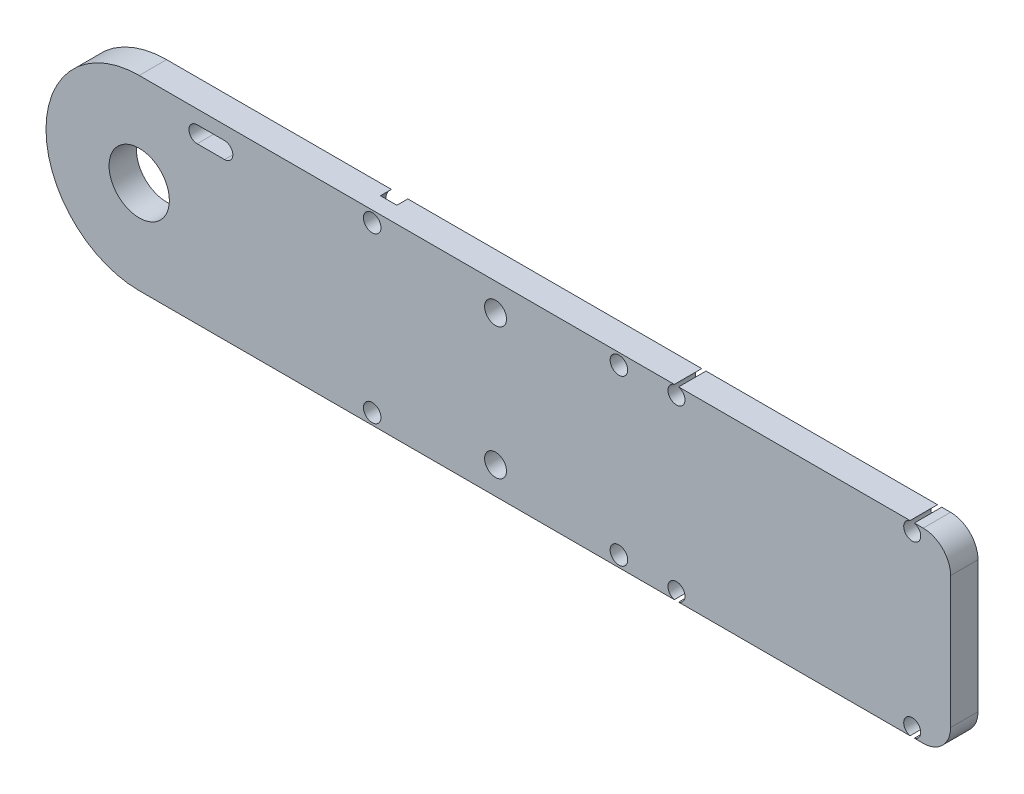
ISO-10303-21;
HEADER;
FILE_DESCRIPTION(('STEP AP214'),'2;1');
FILE_NAME('part.step','',(''),(''),'','','');
FILE_SCHEMA(('AUTOMOTIVE_DESIGN { 1 0 10303 214 1 1 1 1 }'));
ENDSEC;
DATA;
#1=APPLICATION_CONTEXT('core data for automotive mechanical design processes');
#2=APPLICATION_PROTOCOL_DEFINITION('international standard','automotive_design',2000,#1);
#3=PRODUCT_CONTEXT('',#1,'mechanical');
#4=PRODUCT('Part','Part','',(#3));
#5=PRODUCT_RELATED_PRODUCT_CATEGORY('part','',(#4));
#6=PRODUCT_DEFINITION_FORMATION('','',#4);
#7=PRODUCT_DEFINITION_CONTEXT('part definition',#1,'design');
#8=PRODUCT_DEFINITION('design','',#6,#7);
#9=PRODUCT_DEFINITION_SHAPE('','',#8);
#10=(LENGTH_UNIT() NAMED_UNIT(*) SI_UNIT(.MILLI.,.METRE.));
#11=(NAMED_UNIT(*) PLANE_ANGLE_UNIT() SI_UNIT($,.RADIAN.));
#12=(NAMED_UNIT(*) SI_UNIT($,.STERADIAN.) SOLID_ANGLE_UNIT());
#13=UNCERTAINTY_MEASURE_WITH_UNIT(LENGTH_MEASURE(1.E-05),#10,'distance_accuracy_value','');
#14=(GEOMETRIC_REPRESENTATION_CONTEXT(3) GLOBAL_UNCERTAINTY_ASSIGNED_CONTEXT((#13)) GLOBAL_UNIT_ASSIGNED_CONTEXT((#10,
#11,#12)) REPRESENTATION_CONTEXT('',''));
#15=CARTESIAN_POINT('',(0.,0.,0.));
#16=DIRECTION('',(0.,0.,1.));
#17=DIRECTION('',(1.,0.,0.));
#18=AXIS2_PLACEMENT_3D('',#15,#16,#17);
#19=CARTESIAN_POINT('',(42.5,-15.,7.5));
#20=DIRECTION('',(0.,0.,-1.));
#21=DIRECTION('',(-1.,0.,0.));
#22=AXIS2_PLACEMENT_3D('',#19,#20,#21);
#23=CYLINDRICAL_SURFACE('',#22,1.59999999999999);
#24=CARTESIAN_POINT('',(42.5,-15.,2.5));
#25=DIRECTION('',(0.,0.,1.));
#26=DIRECTION('',(1.,0.,0.));
#27=AXIS2_PLACEMENT_3D('',#24,#25,#26);
#28=CIRCLE('',#27,1.59999999999999);
#29=CARTESIAN_POINT('',(44.1,-15.,2.5));
#30=VERTEX_POINT('',#29);
#31=EDGE_CURVE('E352',#30,#30,#28,.T.);
#32=ORIENTED_EDGE('',*,*,#31,.T.);
#33=EDGE_LOOP('',(#32));
#34=FACE_BOUND('',#33,.T.);
#35=CARTESIAN_POINT('',(42.5,-15.,-0.5));
#36=DIRECTION('',(0.,0.,-1.));
#37=DIRECTION('',(-1.,0.,0.));
#38=AXIS2_PLACEMENT_3D('',#35,#36,#37);
#39=CIRCLE('',#38,1.59999999999999);
#40=CARTESIAN_POINT('',(40.9,-15.,-0.5));
#41=VERTEX_POINT('',#40);
#42=EDGE_CURVE('E357',#41,#41,#39,.F.);
#43=ORIENTED_EDGE('',*,*,#42,.F.);
#44=EDGE_LOOP('',(#43));
#45=FACE_BOUND('',#44,.T.);
#46=ADVANCED_FACE('F35',(#34,#45),#23,.F.);
#47=CARTESIAN_POINT('',(42.5,15.,7.5));
#48=DIRECTION('',(0.,0.,-1.));
#49=DIRECTION('',(-1.,0.,0.));
#50=AXIS2_PLACEMENT_3D('',#47,#48,#49);
#51=CYLINDRICAL_SURFACE('',#50,1.59999999999999);
#52=CARTESIAN_POINT('',(42.5,15.,2.5));
#53=DIRECTION('',(0.,0.,1.));
#54=DIRECTION('',(1.,0.,0.));
#55=AXIS2_PLACEMENT_3D('',#52,#53,#54);
#56=CIRCLE('',#55,1.59999999999999);
#57=CARTESIAN_POINT('',(44.1,15.,2.5));
#58=VERTEX_POINT('',#57);
#59=EDGE_CURVE('E262',#58,#58,#56,.F.);
#60=ORIENTED_EDGE('',*,*,#59,.F.);
#61=EDGE_LOOP('',(#60));
#62=FACE_BOUND('',#61,.T.);
#63=CARTESIAN_POINT('',(42.5,15.,-0.5));
#64=DIRECTION('',(0.,0.,-1.));
#65=DIRECTION('',(-1.,0.,0.));
#66=AXIS2_PLACEMENT_3D('',#63,#64,#65);
#67=CIRCLE('',#66,1.59999999999999);
#68=CARTESIAN_POINT('',(40.9,15.,-0.5));
#69=VERTEX_POINT('',#68);
#70=EDGE_CURVE('E359',#69,#69,#67,.T.);
#71=ORIENTED_EDGE('',*,*,#70,.T.);
#72=EDGE_LOOP('',(#71));
#73=FACE_BOUND('',#72,.T.);
#74=ADVANCED_FACE('F456',(#62,#73),#51,.F.);
#75=CARTESIAN_POINT('',(0.,0.,2.5));
#76=DIRECTION('',(0.,0.,1.));
#77=DIRECTION('',(1.,0.,0.));
#78=AXIS2_PLACEMENT_3D('',#75,#76,#77);
#79=PLANE('',#78);
#80=CARTESIAN_POINT('',(65.,-12.,2.5));
#81=DIRECTION('',(0.,0.,-1.));
#82=DIRECTION('',(-1.,0.,0.));
#83=AXIS2_PLACEMENT_3D('',#80,#81,#82);
#84=CIRCLE('',#83,2.);
#85=CARTESIAN_POINT('',(63.,-12.,2.5));
#86=VERTEX_POINT('',#85);
#87=EDGE_CURVE('E310',#86,#86,#84,.F.);
#88=ORIENTED_EDGE('',*,*,#87,.F.);
#89=EDGE_LOOP('',(#88));
#90=FACE_BOUND('',#89,.T.);
#91=CARTESIAN_POINT('',(87.5,15.,2.5));
#92=DIRECTION('',(0.,0.,-1.));
#93=DIRECTION('',(-1.,0.,0.));
#94=AXIS2_PLACEMENT_3D('',#91,#92,#93);
#95=CIRCLE('',#94,1.59999999999999);
#96=CARTESIAN_POINT('',(85.9,15.,2.5));
#97=VERTEX_POINT('',#96);
#98=EDGE_CURVE('E304',#97,#97,#95,.T.);
#99=ORIENTED_EDGE('',*,*,#98,.T.);
#100=EDGE_LOOP('',(#99));
#101=FACE_BOUND('',#100,.T.);
#102=DIRECTION('',(1.,0.,0.));
#103=VECTOR('',#102,1.);
#104=CARTESIAN_POINT('',(0.,-17.,2.5));
#105=LINE('',#104,#103);
#106=CARTESIAN_POINT('',(0.,-17.,2.5));
#107=VERTEX_POINT('',#106);
#108=CARTESIAN_POINT('',(97.6094875162046,-17.,2.5));
#109=VERTEX_POINT('',#108);
#110=EDGE_CURVE('E246',#107,#109,#105,.T.);
#111=ORIENTED_EDGE('',*,*,#110,.T.);
#112=CARTESIAN_POINT('',(98.,-15.5,2.5));
#113=DIRECTION('',(0.,0.,-1.));
#114=DIRECTION('',(-1.,0.,0.));
#115=AXIS2_PLACEMENT_3D('',#112,#113,#114);
#116=CIRCLE('',#115,1.54999999999999);
#117=CARTESIAN_POINT('',(98.3905124837954,-17.,2.5));
#118=VERTEX_POINT('',#117);
#119=EDGE_CURVE('E289',#118,#109,#116,.F.);
#120=ORIENTED_EDGE('',*,*,#119,.F.);
#121=CARTESIAN_POINT('',(140.609487516204,-17.,2.5));
#122=VERTEX_POINT('',#121);
#123=EDGE_CURVE('E249',#118,#122,#105,.T.);
#124=ORIENTED_EDGE('',*,*,#123,.T.);
#125=CARTESIAN_POINT('',(141.,-15.5,2.5));
#126=DIRECTION('',(0.,0.,-1.));
#127=DIRECTION('',(-1.,0.,0.));
#128=AXIS2_PLACEMENT_3D('',#125,#126,#127);
#129=CIRCLE('',#128,1.54999999999999);
#130=CARTESIAN_POINT('',(141.390512483795,-17.,2.5));
#131=VERTEX_POINT('',#130);
#132=EDGE_CURVE('E256',#122,#131,#129,.T.);
#133=ORIENTED_EDGE('',*,*,#132,.T.);
#134=CARTESIAN_POINT('',(143.,-17.,2.5));
#135=VERTEX_POINT('',#134);
#136=EDGE_CURVE('E250',#131,#135,#105,.T.);
#137=ORIENTED_EDGE('',*,*,#136,.T.);
#138=CARTESIAN_POINT('',(143.,-12.,2.5));
#139=DIRECTION('',(0.,0.,1.));
#140=DIRECTION('',(1.,0.,0.));
#141=AXIS2_PLACEMENT_3D('',#138,#139,#140);
#142=CIRCLE('',#141,5.);
#143=CARTESIAN_POINT('',(148.,-12.,2.5));
#144=VERTEX_POINT('',#143);
#145=EDGE_CURVE('E400',#135,#144,#142,.T.);
#146=ORIENTED_EDGE('',*,*,#145,.T.);
#147=DIRECTION('',(0.,-1.,0.));
#148=VECTOR('',#147,1.);
#149=CARTESIAN_POINT('',(148.,0.,2.5));
#150=LINE('',#149,#148);
#151=CARTESIAN_POINT('',(148.,12.,2.5));
#152=VERTEX_POINT('',#151);
#153=EDGE_CURVE('E243',#152,#144,#150,.T.);
#154=ORIENTED_EDGE('',*,*,#153,.F.);
#155=CARTESIAN_POINT('',(143.,12.,2.5));
#156=DIRECTION('',(0.,0.,1.));
#157=DIRECTION('',(1.,0.,0.));
#158=AXIS2_PLACEMENT_3D('',#155,#156,#157);
#159=CIRCLE('',#158,5.);
#160=CARTESIAN_POINT('',(143.,17.,2.5));
#161=VERTEX_POINT('',#160);
#162=EDGE_CURVE('E401',#152,#161,#159,.T.);
#163=ORIENTED_EDGE('',*,*,#162,.T.);
#164=DIRECTION('',(1.,0.,0.));
#165=VECTOR('',#164,1.);
#166=CARTESIAN_POINT('',(0.,17.,2.5));
#167=LINE('',#166,#165);
#168=CARTESIAN_POINT('',(141.390512483795,17.,2.5));
#169=VERTEX_POINT('',#168);
#170=EDGE_CURVE('E242',#169,#161,#167,.T.);
#171=ORIENTED_EDGE('',*,*,#170,.F.);
#172=CARTESIAN_POINT('',(141.,15.5,2.5));
#173=DIRECTION('',(0.,0.,-1.));
#174=DIRECTION('',(-1.,0.,0.));
#175=AXIS2_PLACEMENT_3D('',#172,#173,#174);
#176=CIRCLE('',#175,1.54999999999999);
#177=CARTESIAN_POINT('',(140.609487516205,17.,2.5));
#178=VERTEX_POINT('',#177);
#179=EDGE_CURVE('E269',#178,#169,#176,.F.);
#180=ORIENTED_EDGE('',*,*,#179,.F.);
#181=CARTESIAN_POINT('',(98.3905124837954,17.,2.5));
#182=VERTEX_POINT('',#181);
#183=EDGE_CURVE('E241',#182,#178,#167,.T.);
#184=ORIENTED_EDGE('',*,*,#183,.F.);
#185=CARTESIAN_POINT('',(98.,15.5,2.5));
#186=DIRECTION('',(0.,0.,-1.));
#187=DIRECTION('',(-1.,0.,0.));
#188=AXIS2_PLACEMENT_3D('',#185,#186,#187);
#189=CIRCLE('',#188,1.54999999999999);
#190=CARTESIAN_POINT('',(97.6094875162046,17.,2.5));
#191=VERTEX_POINT('',#190);
#192=EDGE_CURVE('E277',#182,#191,#189,.T.);
#193=ORIENTED_EDGE('',*,*,#192,.T.);
#194=CARTESIAN_POINT('',(0.,17.,2.5));
#195=VERTEX_POINT('',#194);
#196=EDGE_CURVE('E238',#195,#191,#167,.T.);
#197=ORIENTED_EDGE('',*,*,#196,.F.);
#198=CARTESIAN_POINT('',(0.,0.,2.5));
#199=DIRECTION('',(0.,0.,1.));
#200=DIRECTION('',(1.,0.,0.));
#201=AXIS2_PLACEMENT_3D('',#198,#199,#200);
#202=CIRCLE('',#201,17.);
#203=EDGE_CURVE('E211',#195,#107,#202,.T.);
#204=ORIENTED_EDGE('',*,*,#203,.T.);
#205=EDGE_LOOP('',(#111,#120,#124,#133,#137,#146,#154,#163,#171,#180,#184,#193,#197,#204));
#206=FACE_BOUND('',#205,.T.);
#207=CARTESIAN_POINT('',(0.,0.,2.5));
#208=DIRECTION('',(0.,0.,1.));
#209=DIRECTION('',(1.,0.,0.));
#210=AXIS2_PLACEMENT_3D('',#207,#208,#209);
#211=CIRCLE('',#210,5.5);
#212=CARTESIAN_POINT('',(5.5,0.,2.5));
#213=VERTEX_POINT('',#212);
#214=EDGE_CURVE('E234',#213,#213,#211,.T.);
#215=ORIENTED_EDGE('',*,*,#214,.F.);
#216=EDGE_LOOP('',(#215));
#217=FACE_BOUND('',#216,.T.);
#218=CARTESIAN_POINT('',(87.5,-15.,2.5));
#219=DIRECTION('',(0.,0.,-1.));
#220=DIRECTION('',(-1.,0.,0.));
#221=AXIS2_PLACEMENT_3D('',#218,#219,#220);
#222=CIRCLE('',#221,1.59999999999999);
#223=CARTESIAN_POINT('',(85.9,-15.,2.5));
#224=VERTEX_POINT('',#223);
#225=EDGE_CURVE('E298',#224,#224,#222,.F.);
#226=ORIENTED_EDGE('',*,*,#225,.F.);
#227=EDGE_LOOP('',(#226));
#228=FACE_BOUND('',#227,.T.);
#229=CARTESIAN_POINT('',(65.,12.,2.5));
#230=DIRECTION('',(0.,0.,-1.));
#231=DIRECTION('',(-1.,0.,0.));
#232=AXIS2_PLACEMENT_3D('',#229,#230,#231);
#233=CIRCLE('',#232,2.);
#234=CARTESIAN_POINT('',(63.,12.,2.5));
#235=VERTEX_POINT('',#234);
#236=EDGE_CURVE('E316',#235,#235,#233,.T.);
#237=ORIENTED_EDGE('',*,*,#236,.T.);
#238=EDGE_LOOP('',(#237));
#239=FACE_BOUND('',#238,.T.);
#240=DIRECTION('',(-1.,0.,0.));
#241=VECTOR('',#240,1.);
#242=CARTESIAN_POINT('',(0.,11.5,2.5));
#243=LINE('',#242,#241);
#244=CARTESIAN_POINT('',(15.5741759643275,11.5,2.5));
#245=VERTEX_POINT('',#244);
#246=CARTESIAN_POINT('',(10.5741759643275,11.5,2.5));
#247=VERTEX_POINT('',#246);
#248=EDGE_CURVE('E332',#245,#247,#243,.T.);
#249=ORIENTED_EDGE('',*,*,#248,.T.);
#250=CARTESIAN_POINT('',(10.5741759643275,13.,2.5));
#251=DIRECTION('',(0.,0.,-1.));
#252=DIRECTION('',(-1.,0.,0.));
#253=AXIS2_PLACEMENT_3D('',#250,#251,#252);
#254=CIRCLE('',#253,1.5);
#255=CARTESIAN_POINT('',(10.5741759643275,14.5,2.5));
#256=VERTEX_POINT('',#255);
#257=EDGE_CURVE('E345',#247,#256,#254,.T.);
#258=ORIENTED_EDGE('',*,*,#257,.T.);
#259=DIRECTION('',(-1.,0.,0.));
#260=VECTOR('',#259,1.);
#261=CARTESIAN_POINT('',(0.,14.5,2.5));
#262=LINE('',#261,#260);
#263=CARTESIAN_POINT('',(15.5741759643275,14.5,2.5));
#264=VERTEX_POINT('',#263);
#265=EDGE_CURVE('E342',#264,#256,#262,.T.);
#266=ORIENTED_EDGE('',*,*,#265,.F.);
#267=CARTESIAN_POINT('',(15.5741759643275,13.,2.5));
#268=DIRECTION('',(0.,0.,-1.));
#269=DIRECTION('',(-1.,0.,0.));
#270=AXIS2_PLACEMENT_3D('',#267,#268,#269);
#271=CIRCLE('',#270,1.5);
#272=EDGE_CURVE('E324',#264,#245,#271,.T.);
#273=ORIENTED_EDGE('',*,*,#272,.T.);
#274=EDGE_LOOP('',(#249,#258,#266,#273));
#275=FACE_BOUND('',#274,.T.);
#276=ORIENTED_EDGE('',*,*,#31,.F.);
#277=EDGE_LOOP('',(#276));
#278=FACE_BOUND('',#277,.T.);
#279=ORIENTED_EDGE('',*,*,#59,.T.);
#280=EDGE_LOOP('',(#279));
#281=FACE_BOUND('',#280,.T.);
#282=ADVANCED_FACE('F429',(#90,#101,#206,#217,#228,#239,#275,#278,#281),#79,.T.);
#283=CARTESIAN_POINT('',(0.,0.,-2.5));
#284=DIRECTION('',(0.,0.,1.));
#285=DIRECTION('',(1.,0.,0.));
#286=AXIS2_PLACEMENT_3D('',#283,#284,#285);
#287=PLANE('',#286);
#288=CARTESIAN_POINT('',(10.5741759643275,13.,-2.5));
#289=DIRECTION('',(0.,0.,-1.));
#290=DIRECTION('',(-1.,0.,0.));
#291=AXIS2_PLACEMENT_3D('',#288,#289,#290);
#292=CIRCLE('',#291,1.5);
#293=CARTESIAN_POINT('',(10.5741759643275,11.5,-2.5));
#294=VERTEX_POINT('',#293);
#295=CARTESIAN_POINT('',(10.5741759643275,14.5,-2.5));
#296=VERTEX_POINT('',#295);
#297=EDGE_CURVE('E336',#294,#296,#292,.T.);
#298=ORIENTED_EDGE('',*,*,#297,.F.);
#299=DIRECTION('',(-1.,0.,0.));
#300=VECTOR('',#299,1.);
#301=CARTESIAN_POINT('',(0.,11.5,-2.5));
#302=LINE('',#301,#300);
#303=CARTESIAN_POINT('',(15.5741759643275,11.5,-2.5));
#304=VERTEX_POINT('',#303);
#305=EDGE_CURVE('E319',#304,#294,#302,.T.);
#306=ORIENTED_EDGE('',*,*,#305,.F.);
#307=CARTESIAN_POINT('',(15.5741759643275,13.,-2.5));
#308=DIRECTION('',(0.,0.,-1.));
#309=DIRECTION('',(-1.,0.,0.));
#310=AXIS2_PLACEMENT_3D('',#307,#308,#309);
#311=CIRCLE('',#310,1.5);
#312=CARTESIAN_POINT('',(15.5741759643275,14.5,-2.5));
#313=VERTEX_POINT('',#312);
#314=EDGE_CURVE('E329',#313,#304,#311,.T.);
#315=ORIENTED_EDGE('',*,*,#314,.F.);
#316=DIRECTION('',(-1.,0.,0.));
#317=VECTOR('',#316,1.);
#318=CARTESIAN_POINT('',(0.,14.5,-2.5));
#319=LINE('',#318,#317);
#320=EDGE_CURVE('E333',#313,#296,#319,.T.);
#321=ORIENTED_EDGE('',*,*,#320,.T.);
#322=EDGE_LOOP('',(#298,#306,#315,#321));
#323=FACE_BOUND('',#322,.T.);
#324=CARTESIAN_POINT('',(65.,12.,-2.5));
#325=DIRECTION('',(0.,0.,-1.));
#326=DIRECTION('',(-1.,0.,0.));
#327=AXIS2_PLACEMENT_3D('',#324,#325,#326);
#328=CIRCLE('',#327,2.);
#329=CARTESIAN_POINT('',(63.,12.,-2.5));
#330=VERTEX_POINT('',#329);
#331=EDGE_CURVE('E313',#330,#330,#328,.T.);
#332=ORIENTED_EDGE('',*,*,#331,.F.);
#333=EDGE_LOOP('',(#332));
#334=FACE_BOUND('',#333,.T.);
#335=CARTESIAN_POINT('',(87.5,15.,-2.5));
#336=DIRECTION('',(0.,0.,-1.));
#337=DIRECTION('',(-1.,0.,0.));
#338=AXIS2_PLACEMENT_3D('',#335,#336,#337);
#339=CIRCLE('',#338,1.59999999999999);
#340=CARTESIAN_POINT('',(85.9,15.,-2.5));
#341=VERTEX_POINT('',#340);
#342=EDGE_CURVE('E301',#341,#341,#339,.T.);
#343=ORIENTED_EDGE('',*,*,#342,.F.);
#344=EDGE_LOOP('',(#343));
#345=FACE_BOUND('',#344,.T.);
#346=CARTESIAN_POINT('',(0.,0.,-2.5));
#347=DIRECTION('',(0.,0.,1.));
#348=DIRECTION('',(1.,0.,0.));
#349=AXIS2_PLACEMENT_3D('',#346,#347,#348);
#350=CIRCLE('',#349,5.5);
#351=CARTESIAN_POINT('',(5.5,0.,-2.5));
#352=VERTEX_POINT('',#351);
#353=EDGE_CURVE('E206',#352,#352,#350,.T.);
#354=ORIENTED_EDGE('',*,*,#353,.T.);
#355=EDGE_LOOP('',(#354));
#356=FACE_BOUND('',#355,.T.);
#357=DIRECTION('',(1.,0.,0.));
#358=VECTOR('',#357,1.);
#359=CARTESIAN_POINT('',(0.,17.,-2.5));
#360=LINE('',#359,#358);
#361=CARTESIAN_POINT('',(0.,17.,-2.5));
#362=VERTEX_POINT('',#361);
#363=CARTESIAN_POINT('',(41.,17.,-2.5));
#364=VERTEX_POINT('',#363);
#365=EDGE_CURVE('E197',#362,#364,#360,.T.);
#366=ORIENTED_EDGE('',*,*,#365,.T.);
#367=CARTESIAN_POINT('',(42.5,15.,-2.5));
#368=DIRECTION('',(0.,0.,-1.));
#369=DIRECTION('',(-1.,0.,0.));
#370=AXIS2_PLACEMENT_3D('',#367,#368,#369);
#371=CIRCLE('',#370,2.5);
#372=CARTESIAN_POINT('',(44.,17.,-2.5));
#373=VERTEX_POINT('',#372);
#374=EDGE_CURVE('E183',#373,#364,#371,.T.);
#375=ORIENTED_EDGE('',*,*,#374,.F.);
#376=CARTESIAN_POINT('',(97.6094875162046,17.,-2.5));
#377=VERTEX_POINT('',#376);
#378=EDGE_CURVE('E207',#373,#377,#360,.T.);
#379=ORIENTED_EDGE('',*,*,#378,.T.);
#380=CARTESIAN_POINT('',(98.,15.5,-2.5));
#381=DIRECTION('',(0.,0.,-1.));
#382=DIRECTION('',(-1.,0.,0.));
#383=AXIS2_PLACEMENT_3D('',#380,#381,#382);
#384=CIRCLE('',#383,1.54999999999999);
#385=CARTESIAN_POINT('',(98.3905124837954,17.,-2.5));
#386=VERTEX_POINT('',#385);
#387=EDGE_CURVE('E271',#386,#377,#384,.T.);
#388=ORIENTED_EDGE('',*,*,#387,.F.);
#389=CARTESIAN_POINT('',(140.609487516205,17.,-2.5));
#390=VERTEX_POINT('',#389);
#391=EDGE_CURVE('E209',#386,#390,#360,.T.);
#392=ORIENTED_EDGE('',*,*,#391,.T.);
#393=CARTESIAN_POINT('',(141.,15.5,-2.5));
#394=DIRECTION('',(0.,0.,-1.));
#395=DIRECTION('',(-1.,0.,0.));
#396=AXIS2_PLACEMENT_3D('',#393,#394,#395);
#397=CIRCLE('',#396,1.54999999999999);
#398=CARTESIAN_POINT('',(141.390512483795,17.,-2.5));
#399=VERTEX_POINT('',#398);
#400=EDGE_CURVE('E259',#390,#399,#397,.F.);
#401=ORIENTED_EDGE('',*,*,#400,.T.);
#402=CARTESIAN_POINT('',(143.,17.,-2.5));
#403=VERTEX_POINT('',#402);
#404=EDGE_CURVE('E213',#399,#403,#360,.T.);
#405=ORIENTED_EDGE('',*,*,#404,.T.);
#406=CARTESIAN_POINT('',(143.,12.,-2.5));
#407=DIRECTION('',(0.,0.,1.));
#408=DIRECTION('',(1.,0.,0.));
#409=AXIS2_PLACEMENT_3D('',#406,#407,#408);
#410=CIRCLE('',#409,5.);
#411=CARTESIAN_POINT('',(148.,12.,-2.5));
#412=VERTEX_POINT('',#411);
#413=EDGE_CURVE('E397',#403,#412,#410,.F.);
#414=ORIENTED_EDGE('',*,*,#413,.T.);
#415=DIRECTION('',(0.,-1.,0.));
#416=VECTOR('',#415,1.);
#417=CARTESIAN_POINT('',(148.,0.,-2.5));
#418=LINE('',#417,#416);
#419=CARTESIAN_POINT('',(148.,-12.,-2.5));
#420=VERTEX_POINT('',#419);
#421=EDGE_CURVE('E219',#412,#420,#418,.T.);
#422=ORIENTED_EDGE('',*,*,#421,.T.);
#423=CARTESIAN_POINT('',(143.,-12.,-2.5));
#424=DIRECTION('',(0.,0.,1.));
#425=DIRECTION('',(1.,0.,0.));
#426=AXIS2_PLACEMENT_3D('',#423,#424,#425);
#427=CIRCLE('',#426,5.);
#428=CARTESIAN_POINT('',(143.,-17.,-2.5));
#429=VERTEX_POINT('',#428);
#430=EDGE_CURVE('E393',#420,#429,#427,.F.);
#431=ORIENTED_EDGE('',*,*,#430,.T.);
#432=DIRECTION('',(1.,0.,0.));
#433=VECTOR('',#432,1.);
#434=CARTESIAN_POINT('',(0.,-17.,-2.5));
#435=LINE('',#434,#433);
#436=CARTESIAN_POINT('',(141.390512483795,-17.,-2.5));
#437=VERTEX_POINT('',#436);
#438=EDGE_CURVE('E232',#437,#429,#435,.T.);
#439=ORIENTED_EDGE('',*,*,#438,.F.);
#440=CARTESIAN_POINT('',(141.,-15.5,-2.5));
#441=DIRECTION('',(0.,0.,-1.));
#442=DIRECTION('',(-1.,0.,0.));
#443=AXIS2_PLACEMENT_3D('',#440,#441,#442);
#444=CIRCLE('',#443,1.54999999999999);
#445=CARTESIAN_POINT('',(140.609487516204,-17.,-2.5));
#446=VERTEX_POINT('',#445);
#447=EDGE_CURVE('E260',#446,#437,#444,.T.);
#448=ORIENTED_EDGE('',*,*,#447,.F.);
#449=CARTESIAN_POINT('',(98.3905124837954,-17.,-2.5));
#450=VERTEX_POINT('',#449);
#451=EDGE_CURVE('E229',#450,#446,#435,.T.);
#452=ORIENTED_EDGE('',*,*,#451,.F.);
#453=CARTESIAN_POINT('',(98.,-15.5,-2.5));
#454=DIRECTION('',(0.,0.,-1.));
#455=DIRECTION('',(-1.,0.,0.));
#456=AXIS2_PLACEMENT_3D('',#453,#454,#455);
#457=CIRCLE('',#456,1.54999999999999);
#458=CARTESIAN_POINT('',(97.6094875162046,-17.,-2.5));
#459=VERTEX_POINT('',#458);
#460=EDGE_CURVE('E280',#450,#459,#457,.F.);
#461=ORIENTED_EDGE('',*,*,#460,.T.);
#462=CARTESIAN_POINT('',(44.,-17.,-2.5));
#463=VERTEX_POINT('',#462);
#464=EDGE_CURVE('E227',#463,#459,#435,.T.);
#465=ORIENTED_EDGE('',*,*,#464,.F.);
#466=CARTESIAN_POINT('',(42.5,-15.,-2.5));
#467=DIRECTION('',(0.,0.,-1.));
#468=DIRECTION('',(-1.,0.,0.));
#469=AXIS2_PLACEMENT_3D('',#466,#467,#468);
#470=CIRCLE('',#469,2.5);
#471=CARTESIAN_POINT('',(41.,-17.,-2.5));
#472=VERTEX_POINT('',#471);
#473=EDGE_CURVE('E360',#472,#463,#470,.T.);
#474=ORIENTED_EDGE('',*,*,#473,.F.);
#475=CARTESIAN_POINT('',(0.,-17.,-2.5));
#476=VERTEX_POINT('',#475);
#477=EDGE_CURVE('E223',#476,#472,#435,.T.);
#478=ORIENTED_EDGE('',*,*,#477,.F.);
#479=CARTESIAN_POINT('',(0.,0.,-2.5));
#480=DIRECTION('',(0.,0.,1.));
#481=DIRECTION('',(1.,0.,0.));
#482=AXIS2_PLACEMENT_3D('',#479,#480,#481);
#483=CIRCLE('',#482,17.);
#484=EDGE_CURVE('E205',#362,#476,#483,.T.);
#485=ORIENTED_EDGE('',*,*,#484,.F.);
#486=EDGE_LOOP('',(#366,#375,#379,#388,#392,#401,#405,#414,#422,#431,#439,#448,#452,#461,#465,
#474,#478,#485));
#487=FACE_BOUND('',#486,.T.);
#488=CARTESIAN_POINT('',(87.5,-15.,-2.5));
#489=DIRECTION('',(0.,0.,-1.));
#490=DIRECTION('',(-1.,0.,0.));
#491=AXIS2_PLACEMENT_3D('',#488,#489,#490);
#492=CIRCLE('',#491,1.59999999999999);
#493=CARTESIAN_POINT('',(85.9,-15.,-2.5));
#494=VERTEX_POINT('',#493);
#495=EDGE_CURVE('E292',#494,#494,#492,.F.);
#496=ORIENTED_EDGE('',*,*,#495,.T.);
#497=EDGE_LOOP('',(#496));
#498=FACE_BOUND('',#497,.T.);
#499=CARTESIAN_POINT('',(65.,-12.,-2.5));
#500=DIRECTION('',(0.,0.,-1.));
#501=DIRECTION('',(-1.,0.,0.));
#502=AXIS2_PLACEMENT_3D('',#499,#500,#501);
#503=CIRCLE('',#502,2.);
#504=CARTESIAN_POINT('',(63.,-12.,-2.5));
#505=VERTEX_POINT('',#504);
#506=EDGE_CURVE('E307',#505,#505,#503,.F.);
#507=ORIENTED_EDGE('',*,*,#506,.T.);
#508=EDGE_LOOP('',(#507));
#509=FACE_BOUND('',#508,.T.);
#510=ADVANCED_FACE('F202',(#323,#334,#345,#356,#487,#498,#509),#287,.F.);
#511=CARTESIAN_POINT('',(0.,-17.,2.5));
#512=DIRECTION('',(0.,1.,0.));
#513=DIRECTION('',(-1.,0.,0.));
#514=AXIS2_PLACEMENT_3D('',#511,#512,#513);
#515=PLANE('',#514);
#516=DIRECTION('',(0.,0.,-1.));
#517=VECTOR('',#516,1.);
#518=CARTESIAN_POINT('',(98.3905124837954,-17.,2.5));
#519=LINE('',#518,#517);
#520=EDGE_CURVE('E285',#118,#450,#519,.T.);
#521=ORIENTED_EDGE('',*,*,#520,.T.);
#522=ORIENTED_EDGE('',*,*,#451,.T.);
#523=DIRECTION('',(0.,0.,-1.));
#524=VECTOR('',#523,1.);
#525=CARTESIAN_POINT('',(140.609487516204,-17.,2.5));
#526=LINE('',#525,#524);
#527=EDGE_CURVE('E253',#122,#446,#526,.T.);
#528=ORIENTED_EDGE('',*,*,#527,.F.);
#529=ORIENTED_EDGE('',*,*,#123,.F.);
#530=EDGE_LOOP('',(#521,#522,#528,#529));
#531=FACE_BOUND('',#530,.T.);
#532=ADVANCED_FACE('F516',(#531),#515,.F.);
#533=DIRECTION('',(-1.,0.,0.));
#534=VECTOR('',#533,1.);
#535=CARTESIAN_POINT('',(0.,-17.,-0.5));
#536=LINE('',#535,#534);
#537=CARTESIAN_POINT('',(44.,-17.,-0.5));
#538=VERTEX_POINT('',#537);
#539=CARTESIAN_POINT('',(41.,-17.,-0.5));
#540=VERTEX_POINT('',#539);
#541=EDGE_CURVE('E355',#538,#540,#536,.T.);
#542=ORIENTED_EDGE('',*,*,#541,.F.);
#543=DIRECTION('',(0.,0.,-1.));
#544=VECTOR('',#543,1.);
#545=CARTESIAN_POINT('',(44.,-17.,-0.5));
#546=LINE('',#545,#544);
#547=EDGE_CURVE('E11',#538,#463,#546,.T.);
#548=ORIENTED_EDGE('',*,*,#547,.T.);
#549=ORIENTED_EDGE('',*,*,#464,.T.);
#550=DIRECTION('',(0.,0.,-1.));
#551=VECTOR('',#550,1.);
#552=CARTESIAN_POINT('',(97.6094875162046,-17.,2.5));
#553=LINE('',#552,#551);
#554=EDGE_CURVE('E288',#109,#459,#553,.T.);
#555=ORIENTED_EDGE('',*,*,#554,.F.);
#556=ORIENTED_EDGE('',*,*,#110,.F.);
#557=DIRECTION('',(0.,0.,-1.));
#558=VECTOR('',#557,1.);
#559=CARTESIAN_POINT('',(0.,-17.,2.5));
#560=LINE('',#559,#558);
#561=EDGE_CURVE('E422',#107,#476,#560,.T.);
#562=ORIENTED_EDGE('',*,*,#561,.T.);
#563=ORIENTED_EDGE('',*,*,#477,.T.);
#564=DIRECTION('',(0.,0.,-1.));
#565=VECTOR('',#564,1.);
#566=CARTESIAN_POINT('',(41.,-17.,-0.5));
#567=LINE('',#566,#565);
#568=EDGE_CURVE('E43',#472,#540,#567,.F.);
#569=ORIENTED_EDGE('',*,*,#568,.T.);
#570=EDGE_LOOP('',(#542,#548,#549,#555,#556,#562,#563,#569));
#571=FACE_BOUND('',#570,.T.);
#572=ADVANCED_FACE('F375',(#571),#515,.F.);
#573=ORIENTED_EDGE('',*,*,#136,.F.);
#574=DIRECTION('',(0.,0.,-1.));
#575=VECTOR('',#574,1.);
#576=CARTESIAN_POINT('',(141.390512483795,-17.,2.5));
#577=LINE('',#576,#575);
#578=EDGE_CURVE('E255',#131,#437,#577,.T.);
#579=ORIENTED_EDGE('',*,*,#578,.T.);
#580=ORIENTED_EDGE('',*,*,#438,.T.);
#581=DIRECTION('',(0.,0.,-1.));
#582=VECTOR('',#581,1.);
#583=CARTESIAN_POINT('',(143.,-17.,2.5));
#584=LINE('',#583,#582);
#585=EDGE_CURVE('E390',#429,#135,#584,.F.);
#586=ORIENTED_EDGE('',*,*,#585,.T.);
#587=EDGE_LOOP('',(#573,#579,#580,#586));
#588=FACE_BOUND('',#587,.T.);
#589=ADVANCED_FACE('F388',(#588),#515,.F.);
#590=CARTESIAN_POINT('',(0.,17.,2.5));
#591=DIRECTION('',(0.,1.,0.));
#592=DIRECTION('',(-1.,0.,0.));
#593=AXIS2_PLACEMENT_3D('',#590,#591,#592);
#594=PLANE('',#593);
#595=DIRECTION('',(0.,0.,-1.));
#596=VECTOR('',#595,1.);
#597=CARTESIAN_POINT('',(98.3905124837954,17.,2.5));
#598=LINE('',#597,#596);
#599=EDGE_CURVE('E274',#182,#386,#598,.T.);
#600=ORIENTED_EDGE('',*,*,#599,.F.);
#601=ORIENTED_EDGE('',*,*,#183,.T.);
#602=DIRECTION('',(0.,0.,-1.));
#603=VECTOR('',#602,1.);
#604=CARTESIAN_POINT('',(140.609487516205,17.,2.5));
#605=LINE('',#604,#603);
#606=EDGE_CURVE('E265',#178,#390,#605,.T.);
#607=ORIENTED_EDGE('',*,*,#606,.T.);
#608=ORIENTED_EDGE('',*,*,#391,.F.);
#609=EDGE_LOOP('',(#600,#601,#607,#608));
#610=FACE_BOUND('',#609,.T.);
#611=ADVANCED_FACE('F438',(#610),#594,.T.);
#612=ORIENTED_EDGE('',*,*,#404,.F.);
#613=DIRECTION('',(0.,0.,-1.));
#614=VECTOR('',#613,1.);
#615=CARTESIAN_POINT('',(141.390512483795,17.,2.5));
#616=LINE('',#615,#614);
#617=EDGE_CURVE('E268',#169,#399,#616,.T.);
#618=ORIENTED_EDGE('',*,*,#617,.F.);
#619=ORIENTED_EDGE('',*,*,#170,.T.);
#620=DIRECTION('',(0.,0.,-1.));
#621=VECTOR('',#620,1.);
#622=CARTESIAN_POINT('',(143.,17.,2.5));
#623=LINE('',#622,#621);
#624=EDGE_CURVE('E199',#161,#403,#623,.T.);
#625=ORIENTED_EDGE('',*,*,#624,.T.);
#626=EDGE_LOOP('',(#612,#618,#619,#625));
#627=FACE_BOUND('',#626,.T.);
#628=ADVANCED_FACE('F411',(#627),#594,.T.);
#629=DIRECTION('',(0.,0.,-1.));
#630=VECTOR('',#629,1.);
#631=CARTESIAN_POINT('',(44.,17.,-0.5));
#632=LINE('',#631,#630);
#633=CARTESIAN_POINT('',(44.,17.,-0.5));
#634=VERTEX_POINT('',#633);
#635=EDGE_CURVE('E189',#634,#373,#632,.T.);
#636=ORIENTED_EDGE('',*,*,#635,.F.);
#637=DIRECTION('',(-1.,0.,0.));
#638=VECTOR('',#637,1.);
#639=CARTESIAN_POINT('',(0.,17.,-0.5));
#640=LINE('',#639,#638);
#641=CARTESIAN_POINT('',(41.,17.,-0.5));
#642=VERTEX_POINT('',#641);
#643=EDGE_CURVE('E198',#634,#642,#640,.T.);
#644=ORIENTED_EDGE('',*,*,#643,.T.);
#645=DIRECTION('',(0.,0.,-1.));
#646=VECTOR('',#645,1.);
#647=CARTESIAN_POINT('',(41.,17.,-0.5));
#648=LINE('',#647,#646);
#649=EDGE_CURVE('E186',#364,#642,#648,.F.);
#650=ORIENTED_EDGE('',*,*,#649,.F.);
#651=ORIENTED_EDGE('',*,*,#365,.F.);
#652=DIRECTION('',(0.,0.,-1.));
#653=VECTOR('',#652,1.);
#654=CARTESIAN_POINT('',(0.,17.,2.5));
#655=LINE('',#654,#653);
#656=EDGE_CURVE('E237',#195,#362,#655,.T.);
#657=ORIENTED_EDGE('',*,*,#656,.F.);
#658=ORIENTED_EDGE('',*,*,#196,.T.);
#659=DIRECTION('',(0.,0.,-1.));
#660=VECTOR('',#659,1.);
#661=CARTESIAN_POINT('',(97.6094875162046,17.,2.5));
#662=LINE('',#661,#660);
#663=EDGE_CURVE('E276',#191,#377,#662,.T.);
#664=ORIENTED_EDGE('',*,*,#663,.T.);
#665=ORIENTED_EDGE('',*,*,#378,.F.);
#666=EDGE_LOOP('',(#636,#644,#650,#651,#657,#658,#664,#665));
#667=FACE_BOUND('',#666,.T.);
#668=ADVANCED_FACE('F196',(#667),#594,.T.);
#669=CARTESIAN_POINT('',(0.,0.,2.5));
#670=DIRECTION('',(0.,0.,-1.));
#671=DIRECTION('',(-1.,0.,0.));
#672=AXIS2_PLACEMENT_3D('',#669,#670,#671);
#673=CYLINDRICAL_SURFACE('',#672,17.);
#674=ORIENTED_EDGE('',*,*,#484,.T.);
#675=ORIENTED_EDGE('',*,*,#561,.F.);
#676=ORIENTED_EDGE('',*,*,#203,.F.);
#677=ORIENTED_EDGE('',*,*,#656,.T.);
#678=EDGE_LOOP('',(#674,#675,#676,#677));
#679=FACE_BOUND('',#678,.T.);
#680=ADVANCED_FACE('F426',(#679),#673,.T.);
#681=CARTESIAN_POINT('',(148.,0.,2.5));
#682=DIRECTION('',(1.,0.,0.));
#683=DIRECTION('',(0.,0.,-1.));
#684=AXIS2_PLACEMENT_3D('',#681,#682,#683);
#685=PLANE('',#684);
#686=ORIENTED_EDGE('',*,*,#153,.T.);
#687=DIRECTION('',(0.,0.,-1.));
#688=VECTOR('',#687,1.);
#689=CARTESIAN_POINT('',(148.,-12.,-2.5));
#690=LINE('',#689,#688);
#691=EDGE_CURVE('E418',#144,#420,#690,.T.);
#692=ORIENTED_EDGE('',*,*,#691,.T.);
#693=ORIENTED_EDGE('',*,*,#421,.F.);
#694=DIRECTION('',(0.,0.,-1.));
#695=VECTOR('',#694,1.);
#696=CARTESIAN_POINT('',(148.,12.,2.5));
#697=LINE('',#696,#695);
#698=EDGE_CURVE('E417',#412,#152,#697,.F.);
#699=ORIENTED_EDGE('',*,*,#698,.T.);
#700=EDGE_LOOP('',(#686,#692,#693,#699));
#701=FACE_BOUND('',#700,.T.);
#702=ADVANCED_FACE('F442',(#701),#685,.T.);
#703=CARTESIAN_POINT('',(0.,0.,2.5));
#704=DIRECTION('',(0.,0.,-1.));
#705=DIRECTION('',(-1.,0.,0.));
#706=AXIS2_PLACEMENT_3D('',#703,#704,#705);
#707=CYLINDRICAL_SURFACE('',#706,5.5);
#708=ORIENTED_EDGE('',*,*,#214,.T.);
#709=EDGE_LOOP('',(#708));
#710=FACE_BOUND('',#709,.T.);
#711=ORIENTED_EDGE('',*,*,#353,.F.);
#712=EDGE_LOOP('',(#711));
#713=FACE_BOUND('',#712,.T.);
#714=ADVANCED_FACE('F444',(#710,#713),#707,.F.);
#715=CARTESIAN_POINT('',(143.,-12.,2.5));
#716=DIRECTION('',(0.,0.,1.));
#717=DIRECTION('',(1.,0.,0.));
#718=AXIS2_PLACEMENT_3D('',#715,#716,#717);
#719=CYLINDRICAL_SURFACE('',#718,5.);
#720=ORIENTED_EDGE('',*,*,#145,.F.);
#721=ORIENTED_EDGE('',*,*,#585,.F.);
#722=ORIENTED_EDGE('',*,*,#430,.F.);
#723=ORIENTED_EDGE('',*,*,#691,.F.);
#724=EDGE_LOOP('',(#720,#721,#722,#723));
#725=FACE_BOUND('',#724,.T.);
#726=ADVANCED_FACE('F399',(#725),#719,.T.);
#727=CARTESIAN_POINT('',(143.,12.,2.5));
#728=DIRECTION('',(0.,0.,-1.));
#729=DIRECTION('',(-1.,0.,0.));
#730=AXIS2_PLACEMENT_3D('',#727,#728,#729);
#731=CYLINDRICAL_SURFACE('',#730,5.);
#732=ORIENTED_EDGE('',*,*,#162,.F.);
#733=ORIENTED_EDGE('',*,*,#698,.F.);
#734=ORIENTED_EDGE('',*,*,#413,.F.);
#735=ORIENTED_EDGE('',*,*,#624,.F.);
#736=EDGE_LOOP('',(#732,#733,#734,#735));
#737=FACE_BOUND('',#736,.T.);
#738=ADVANCED_FACE('F37',(#737),#731,.T.);
#739=CARTESIAN_POINT('',(141.,-15.5,2.5));
#740=DIRECTION('',(0.,0.,-1.));
#741=DIRECTION('',(-1.,0.,0.));
#742=AXIS2_PLACEMENT_3D('',#739,#740,#741);
#743=CYLINDRICAL_SURFACE('',#742,1.54999999999999);
#744=ORIENTED_EDGE('',*,*,#447,.T.);
#745=ORIENTED_EDGE('',*,*,#578,.F.);
#746=ORIENTED_EDGE('',*,*,#132,.F.);
#747=ORIENTED_EDGE('',*,*,#527,.T.);
#748=EDGE_LOOP('',(#744,#745,#746,#747));
#749=FACE_BOUND('',#748,.T.);
#750=ADVANCED_FACE('F508',(#749),#743,.F.);
#751=CARTESIAN_POINT('',(141.,15.5,2.5));
#752=DIRECTION('',(0.,0.,-1.));
#753=DIRECTION('',(-1.,0.,0.));
#754=AXIS2_PLACEMENT_3D('',#751,#752,#753);
#755=CYLINDRICAL_SURFACE('',#754,1.54999999999999);
#756=ORIENTED_EDGE('',*,*,#400,.F.);
#757=ORIENTED_EDGE('',*,*,#606,.F.);
#758=ORIENTED_EDGE('',*,*,#179,.T.);
#759=ORIENTED_EDGE('',*,*,#617,.T.);
#760=EDGE_LOOP('',(#756,#757,#758,#759));
#761=FACE_BOUND('',#760,.T.);
#762=ADVANCED_FACE('F440',(#761),#755,.F.);
#763=CARTESIAN_POINT('',(98.,15.5,2.5));
#764=DIRECTION('',(0.,0.,-1.));
#765=DIRECTION('',(-1.,0.,0.));
#766=AXIS2_PLACEMENT_3D('',#763,#764,#765);
#767=CYLINDRICAL_SURFACE('',#766,1.54999999999999);
#768=ORIENTED_EDGE('',*,*,#387,.T.);
#769=ORIENTED_EDGE('',*,*,#663,.F.);
#770=ORIENTED_EDGE('',*,*,#192,.F.);
#771=ORIENTED_EDGE('',*,*,#599,.T.);
#772=EDGE_LOOP('',(#768,#769,#770,#771));
#773=FACE_BOUND('',#772,.T.);
#774=ADVANCED_FACE('F436',(#773),#767,.F.);
#775=CARTESIAN_POINT('',(98.,-15.5,2.5));
#776=DIRECTION('',(0.,0.,-1.));
#777=DIRECTION('',(-1.,0.,0.));
#778=AXIS2_PLACEMENT_3D('',#775,#776,#777);
#779=CYLINDRICAL_SURFACE('',#778,1.54999999999999);
#780=ORIENTED_EDGE('',*,*,#460,.F.);
#781=ORIENTED_EDGE('',*,*,#520,.F.);
#782=ORIENTED_EDGE('',*,*,#119,.T.);
#783=ORIENTED_EDGE('',*,*,#554,.T.);
#784=EDGE_LOOP('',(#780,#781,#782,#783));
#785=FACE_BOUND('',#784,.T.);
#786=ADVANCED_FACE('F499',(#785),#779,.F.);
#787=CARTESIAN_POINT('',(87.5,-15.,2.5));
#788=DIRECTION('',(0.,0.,-1.));
#789=DIRECTION('',(-1.,0.,0.));
#790=AXIS2_PLACEMENT_3D('',#787,#788,#789);
#791=CYLINDRICAL_SURFACE('',#790,1.59999999999999);
#792=ORIENTED_EDGE('',*,*,#225,.T.);
#793=EDGE_LOOP('',(#792));
#794=FACE_BOUND('',#793,.T.);
#795=ORIENTED_EDGE('',*,*,#495,.F.);
#796=EDGE_LOOP('',(#795));
#797=FACE_BOUND('',#796,.T.);
#798=ADVANCED_FACE('F495',(#794,#797),#791,.F.);
#799=CARTESIAN_POINT('',(87.5,15.,2.5));
#800=DIRECTION('',(0.,0.,-1.));
#801=DIRECTION('',(-1.,0.,0.));
#802=AXIS2_PLACEMENT_3D('',#799,#800,#801);
#803=CYLINDRICAL_SURFACE('',#802,1.59999999999999);
#804=ORIENTED_EDGE('',*,*,#98,.F.);
#805=EDGE_LOOP('',(#804));
#806=FACE_BOUND('',#805,.T.);
#807=ORIENTED_EDGE('',*,*,#342,.T.);
#808=EDGE_LOOP('',(#807));
#809=FACE_BOUND('',#808,.T.);
#810=ADVANCED_FACE('F491',(#806,#809),#803,.F.);
#811=CARTESIAN_POINT('',(65.,-12.,2.5));
#812=DIRECTION('',(0.,0.,-1.));
#813=DIRECTION('',(-1.,0.,0.));
#814=AXIS2_PLACEMENT_3D('',#811,#812,#813);
#815=CYLINDRICAL_SURFACE('',#814,2.);
#816=ORIENTED_EDGE('',*,*,#87,.T.);
#817=EDGE_LOOP('',(#816));
#818=FACE_BOUND('',#817,.T.);
#819=ORIENTED_EDGE('',*,*,#506,.F.);
#820=EDGE_LOOP('',(#819));
#821=FACE_BOUND('',#820,.T.);
#822=ADVANCED_FACE('F487',(#818,#821),#815,.F.);
#823=CARTESIAN_POINT('',(65.,12.,2.5));
#824=DIRECTION('',(0.,0.,-1.));
#825=DIRECTION('',(-1.,0.,0.));
#826=AXIS2_PLACEMENT_3D('',#823,#824,#825);
#827=CYLINDRICAL_SURFACE('',#826,2.);
#828=ORIENTED_EDGE('',*,*,#236,.F.);
#829=EDGE_LOOP('',(#828));
#830=FACE_BOUND('',#829,.T.);
#831=ORIENTED_EDGE('',*,*,#331,.T.);
#832=EDGE_LOOP('',(#831));
#833=FACE_BOUND('',#832,.T.);
#834=ADVANCED_FACE('F483',(#830,#833),#827,.F.);
#835=CARTESIAN_POINT('',(0.,11.5,2.5));
#836=DIRECTION('',(0.,-1.,0.));
#837=DIRECTION('',(0.,0.,-1.));
#838=AXIS2_PLACEMENT_3D('',#835,#836,#837);
#839=PLANE('',#838);
#840=ORIENTED_EDGE('',*,*,#305,.T.);
#841=DIRECTION('',(0.,0.,-1.));
#842=VECTOR('',#841,1.);
#843=CARTESIAN_POINT('',(10.5741759643275,11.5,2.5));
#844=LINE('',#843,#842);
#845=EDGE_CURVE('E320',#247,#294,#844,.T.);
#846=ORIENTED_EDGE('',*,*,#845,.F.);
#847=ORIENTED_EDGE('',*,*,#248,.F.);
#848=DIRECTION('',(0.,0.,-1.));
#849=VECTOR('',#848,1.);
#850=CARTESIAN_POINT('',(15.5741759643275,11.5,2.5));
#851=LINE('',#850,#849);
#852=EDGE_CURVE('E233',#245,#304,#851,.T.);
#853=ORIENTED_EDGE('',*,*,#852,.T.);
#854=EDGE_LOOP('',(#840,#846,#847,#853));
#855=FACE_BOUND('',#854,.T.);
#856=ADVANCED_FACE('F472',(#855),#839,.F.);
#857=CARTESIAN_POINT('',(15.5741759643275,13.,2.5));
#858=DIRECTION('',(0.,0.,-1.));
#859=DIRECTION('',(-1.,0.,0.));
#860=AXIS2_PLACEMENT_3D('',#857,#858,#859);
#861=CYLINDRICAL_SURFACE('',#860,1.5);
#862=ORIENTED_EDGE('',*,*,#314,.T.);
#863=ORIENTED_EDGE('',*,*,#852,.F.);
#864=ORIENTED_EDGE('',*,*,#272,.F.);
#865=DIRECTION('',(0.,0.,-1.));
#866=VECTOR('',#865,1.);
#867=CARTESIAN_POINT('',(15.5741759643275,14.5,2.5));
#868=LINE('',#867,#866);
#869=EDGE_CURVE('E326',#264,#313,#868,.T.);
#870=ORIENTED_EDGE('',*,*,#869,.T.);
#871=EDGE_LOOP('',(#862,#863,#864,#870));
#872=FACE_BOUND('',#871,.T.);
#873=ADVANCED_FACE('F468',(#872),#861,.F.);
#874=CARTESIAN_POINT('',(0.,14.5,2.5));
#875=DIRECTION('',(0.,-1.,0.));
#876=DIRECTION('',(0.,0.,-1.));
#877=AXIS2_PLACEMENT_3D('',#874,#875,#876);
#878=PLANE('',#877);
#879=ORIENTED_EDGE('',*,*,#320,.F.);
#880=ORIENTED_EDGE('',*,*,#869,.F.);
#881=ORIENTED_EDGE('',*,*,#265,.T.);
#882=DIRECTION('',(0.,0.,-1.));
#883=VECTOR('',#882,1.);
#884=CARTESIAN_POINT('',(10.5741759643275,14.5,2.5));
#885=LINE('',#884,#883);
#886=EDGE_CURVE('E323',#256,#296,#885,.T.);
#887=ORIENTED_EDGE('',*,*,#886,.T.);
#888=EDGE_LOOP('',(#879,#880,#881,#887));
#889=FACE_BOUND('',#888,.T.);
#890=ADVANCED_FACE('F471',(#889),#878,.T.);
#891=CARTESIAN_POINT('',(10.5741759643275,13.,2.5));
#892=DIRECTION('',(0.,0.,-1.));
#893=DIRECTION('',(-1.,0.,0.));
#894=AXIS2_PLACEMENT_3D('',#891,#892,#893);
#895=CYLINDRICAL_SURFACE('',#894,1.5);
#896=ORIENTED_EDGE('',*,*,#297,.T.);
#897=ORIENTED_EDGE('',*,*,#886,.F.);
#898=ORIENTED_EDGE('',*,*,#257,.F.);
#899=ORIENTED_EDGE('',*,*,#845,.T.);
#900=EDGE_LOOP('',(#896,#897,#898,#899));
#901=FACE_BOUND('',#900,.T.);
#902=ADVANCED_FACE('F476',(#901),#895,.F.);
#903=CARTESIAN_POINT('',(42.5,15.,-0.5));
#904=DIRECTION('',(0.,0.,-1.));
#905=DIRECTION('',(-1.,0.,0.));
#906=AXIS2_PLACEMENT_3D('',#903,#904,#905);
#907=CYLINDRICAL_SURFACE('',#906,2.5);
#908=ORIENTED_EDGE('',*,*,#635,.T.);
#909=ORIENTED_EDGE('',*,*,#374,.T.);
#910=ORIENTED_EDGE('',*,*,#649,.T.);
#911=CARTESIAN_POINT('',(42.5,15.,-0.5));
#912=DIRECTION('',(0.,0.,-1.));
#913=DIRECTION('',(-1.,0.,0.));
#914=AXIS2_PLACEMENT_3D('',#911,#912,#913);
#915=CIRCLE('',#914,2.5);
#916=EDGE_CURVE('E56',#634,#642,#915,.T.);
#917=ORIENTED_EDGE('',*,*,#916,.F.);
#918=EDGE_LOOP('',(#908,#909,#910,#917));
#919=FACE_BOUND('',#918,.T.);
#920=ADVANCED_FACE('F185',(#919),#907,.F.);
#921=CARTESIAN_POINT('',(42.5,15.,-0.5));
#922=DIRECTION('',(0.,0.,-1.));
#923=DIRECTION('',(-1.,0.,0.));
#924=AXIS2_PLACEMENT_3D('',#921,#922,#923);
#925=PLANE('',#924);
#926=ORIENTED_EDGE('',*,*,#70,.F.);
#927=EDGE_LOOP('',(#926));
#928=FACE_BOUND('',#927,.T.);
#929=ORIENTED_EDGE('',*,*,#916,.T.);
#930=ORIENTED_EDGE('',*,*,#643,.F.);
#931=EDGE_LOOP('',(#929,#930));
#932=FACE_BOUND('',#931,.T.);
#933=ADVANCED_FACE('F707',(#928,#932),#925,.T.);
#934=CARTESIAN_POINT('',(42.5,-15.,-0.5));
#935=DIRECTION('',(0.,0.,-1.));
#936=DIRECTION('',(-1.,0.,0.));
#937=AXIS2_PLACEMENT_3D('',#934,#935,#936);
#938=CYLINDRICAL_SURFACE('',#937,2.5);
#939=CARTESIAN_POINT('',(42.5,-15.,-0.5));
#940=DIRECTION('',(0.,0.,-1.));
#941=DIRECTION('',(-1.,0.,0.));
#942=AXIS2_PLACEMENT_3D('',#939,#940,#941);
#943=CIRCLE('',#942,2.5);
#944=EDGE_CURVE('E49',#540,#538,#943,.T.);
#945=ORIENTED_EDGE('',*,*,#944,.F.);
#946=ORIENTED_EDGE('',*,*,#568,.F.);
#947=ORIENTED_EDGE('',*,*,#473,.T.);
#948=ORIENTED_EDGE('',*,*,#547,.F.);
#949=EDGE_LOOP('',(#945,#946,#947,#948));
#950=FACE_BOUND('',#949,.T.);
#951=ADVANCED_FACE('F379',(#950),#938,.F.);
#952=CARTESIAN_POINT('',(42.5,-15.,-0.5));
#953=DIRECTION('',(0.,0.,-1.));
#954=DIRECTION('',(-1.,0.,0.));
#955=AXIS2_PLACEMENT_3D('',#952,#953,#954);
#956=PLANE('',#955);
#957=ORIENTED_EDGE('',*,*,#42,.T.);
#958=EDGE_LOOP('',(#957));
#959=FACE_BOUND('',#958,.T.);
#960=ORIENTED_EDGE('',*,*,#541,.T.);
#961=ORIENTED_EDGE('',*,*,#944,.T.);
#962=EDGE_LOOP('',(#960,#961));
#963=FACE_BOUND('',#962,.T.);
#964=ADVANCED_FACE('F723',(#959,#963),#956,.T.);
#965=CLOSED_SHELL('',(#46,#74,#282,#510,#532,#572,#589,#611,#628,#668,#680,#702,#714,#726,#738,
#750,#762,#774,#786,#798,#810,#822,#834,#856,#873,#890,#902,#920,#933,#951,#964));
#966=MANIFOLD_SOLID_BREP('B2',#965);
#967=ADVANCED_BREP_SHAPE_REPRESENTATION('',(#18,#966),#14);
#968=SHAPE_DEFINITION_REPRESENTATION(#9,#967);
ENDSEC;
END-ISO-10303-21;
